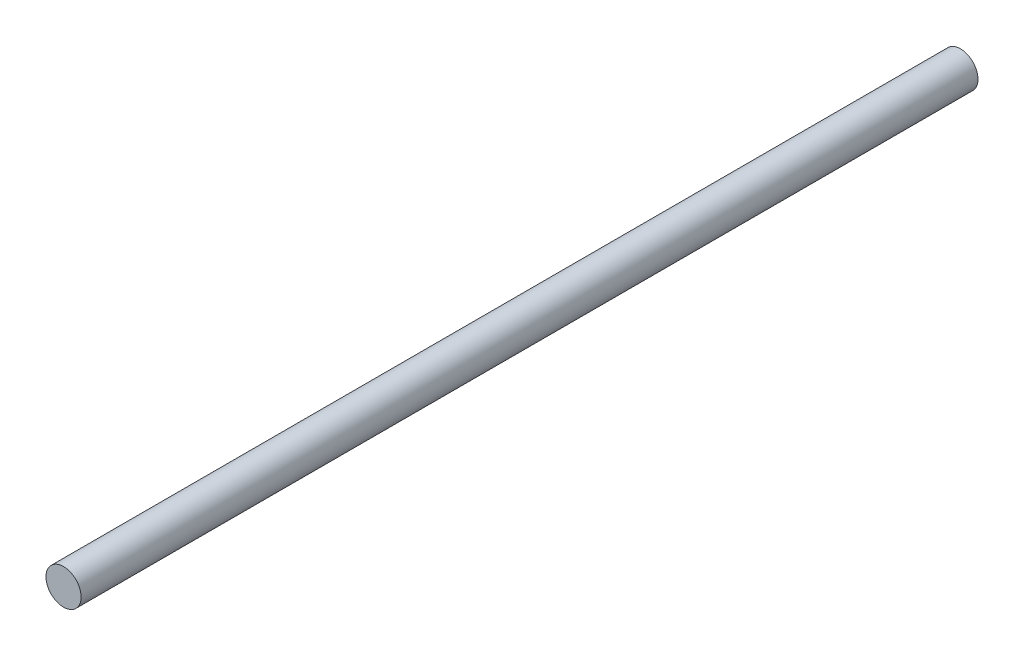
ISO-10303-21;
HEADER;
FILE_DESCRIPTION(('STEP AP214'),'2;1');
FILE_NAME('part.step','',(''),(''),'','','');
FILE_SCHEMA(('AUTOMOTIVE_DESIGN { 1 0 10303 214 1 1 1 1 }'));
ENDSEC;
DATA;
#1=APPLICATION_CONTEXT('core data for automotive mechanical design processes');
#2=APPLICATION_PROTOCOL_DEFINITION('international standard','automotive_design',2000,#1);
#3=PRODUCT_CONTEXT('',#1,'mechanical');
#4=PRODUCT('Part','Part','',(#3));
#5=PRODUCT_RELATED_PRODUCT_CATEGORY('part','',(#4));
#6=PRODUCT_DEFINITION_FORMATION('','',#4);
#7=PRODUCT_DEFINITION_CONTEXT('part definition',#1,'design');
#8=PRODUCT_DEFINITION('design','',#6,#7);
#9=PRODUCT_DEFINITION_SHAPE('','',#8);
#10=(LENGTH_UNIT() NAMED_UNIT(*) SI_UNIT(.MILLI.,.METRE.));
#11=(NAMED_UNIT(*) PLANE_ANGLE_UNIT() SI_UNIT($,.RADIAN.));
#12=(NAMED_UNIT(*) SI_UNIT($,.STERADIAN.) SOLID_ANGLE_UNIT());
#13=UNCERTAINTY_MEASURE_WITH_UNIT(LENGTH_MEASURE(1.E-05),#10,'distance_accuracy_value','');
#14=(GEOMETRIC_REPRESENTATION_CONTEXT(3) GLOBAL_UNCERTAINTY_ASSIGNED_CONTEXT((#13)) GLOBAL_UNIT_ASSIGNED_CONTEXT((#10,
#11,#12)) REPRESENTATION_CONTEXT('',''));
#15=CARTESIAN_POINT('',(0.,0.,0.));
#16=DIRECTION('',(0.,0.,1.));
#17=DIRECTION('',(1.,0.,0.));
#18=AXIS2_PLACEMENT_3D('',#15,#16,#17);
#19=CARTESIAN_POINT('',(0.,0.,121.4628));
#20=DIRECTION('',(0.,0.,-1.));
#21=DIRECTION('',(-1.,0.,0.));
#22=AXIS2_PLACEMENT_3D('',#19,#20,#21);
#23=CYLINDRICAL_SURFACE('',#22,2.38125);
#24=CARTESIAN_POINT('',(0.,0.,121.4628));
#25=DIRECTION('',(0.,0.,1.));
#26=DIRECTION('',(1.,0.,0.));
#27=AXIS2_PLACEMENT_3D('',#24,#25,#26);
#28=CIRCLE('',#27,2.38125);
#29=CARTESIAN_POINT('',(2.38125,0.,121.4628));
#30=VERTEX_POINT('',#29);
#31=EDGE_CURVE('E10',#30,#30,#28,.T.);
#32=ORIENTED_EDGE('',*,*,#31,.F.);
#33=EDGE_LOOP('',(#32));
#34=FACE_BOUND('',#33,.T.);
#35=CARTESIAN_POINT('',(0.,0.,0.));
#36=DIRECTION('',(0.,0.,1.));
#37=DIRECTION('',(1.,0.,0.));
#38=AXIS2_PLACEMENT_3D('',#35,#36,#37);
#39=CIRCLE('',#38,2.38125);
#40=CARTESIAN_POINT('',(2.38125,0.,0.));
#41=VERTEX_POINT('',#40);
#42=EDGE_CURVE('E34',#41,#41,#39,.T.);
#43=ORIENTED_EDGE('',*,*,#42,.T.);
#44=EDGE_LOOP('',(#43));
#45=FACE_BOUND('',#44,.T.);
#46=ADVANCED_FACE('F31',(#34,#45),#23,.T.);
#47=CARTESIAN_POINT('',(0.,0.,121.4628));
#48=DIRECTION('',(0.,0.,1.));
#49=DIRECTION('',(1.,0.,0.));
#50=AXIS2_PLACEMENT_3D('',#47,#48,#49);
#51=PLANE('',#50);
#52=ORIENTED_EDGE('',*,*,#31,.T.);
#53=EDGE_LOOP('',(#52));
#54=FACE_BOUND('',#53,.T.);
#55=ADVANCED_FACE('F46',(#54),#51,.T.);
#56=CARTESIAN_POINT('',(0.,0.,0.));
#57=DIRECTION('',(0.,0.,1.));
#58=DIRECTION('',(1.,0.,0.));
#59=AXIS2_PLACEMENT_3D('',#56,#57,#58);
#60=PLANE('',#59);
#61=ORIENTED_EDGE('',*,*,#42,.F.);
#62=EDGE_LOOP('',(#61));
#63=FACE_BOUND('',#62,.T.);
#64=ADVANCED_FACE('F44',(#63),#60,.F.);
#65=CLOSED_SHELL('',(#46,#55,#64));
#66=MANIFOLD_SOLID_BREP('B2',#65);
#67=ADVANCED_BREP_SHAPE_REPRESENTATION('',(#18,#66),#14);
#68=SHAPE_DEFINITION_REPRESENTATION(#9,#67);
ENDSEC;
END-ISO-10303-21;
